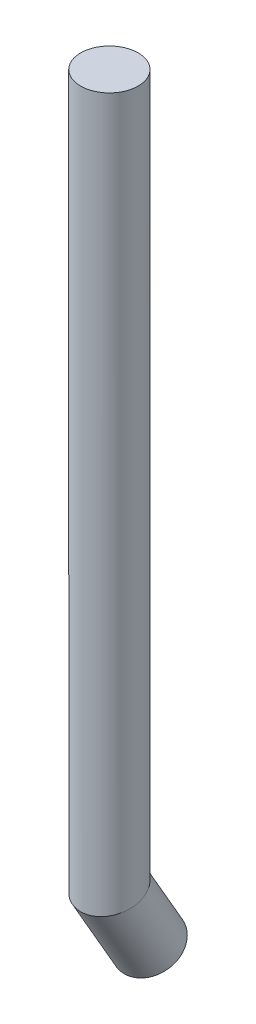
ISO-10303-21;
HEADER;
FILE_DESCRIPTION(('STEP AP214'),'2;1');
FILE_NAME('part.step','',(''),(''),'','','');
FILE_SCHEMA(('AUTOMOTIVE_DESIGN { 1 0 10303 214 1 1 1 1 }'));
ENDSEC;
DATA;
#1=APPLICATION_CONTEXT('core data for automotive mechanical design processes');
#2=APPLICATION_PROTOCOL_DEFINITION('international standard','automotive_design',2000,#1);
#3=PRODUCT_CONTEXT('',#1,'mechanical');
#4=PRODUCT('Part','Part','',(#3));
#5=PRODUCT_RELATED_PRODUCT_CATEGORY('part','',(#4));
#6=PRODUCT_DEFINITION_FORMATION('','',#4);
#7=PRODUCT_DEFINITION_CONTEXT('part definition',#1,'design');
#8=PRODUCT_DEFINITION('design','',#6,#7);
#9=PRODUCT_DEFINITION_SHAPE('','',#8);
#10=(LENGTH_UNIT() NAMED_UNIT(*) SI_UNIT(.MILLI.,.METRE.));
#11=(NAMED_UNIT(*) PLANE_ANGLE_UNIT() SI_UNIT($,.RADIAN.));
#12=(NAMED_UNIT(*) SI_UNIT($,.STERADIAN.) SOLID_ANGLE_UNIT());
#13=UNCERTAINTY_MEASURE_WITH_UNIT(LENGTH_MEASURE(1.E-05),#10,'distance_accuracy_value','');
#14=(GEOMETRIC_REPRESENTATION_CONTEXT(3) GLOBAL_UNCERTAINTY_ASSIGNED_CONTEXT((#13)) GLOBAL_UNIT_ASSIGNED_CONTEXT((#10,
#11,#12)) REPRESENTATION_CONTEXT('',''));
#15=CARTESIAN_POINT('',(0.,0.,0.));
#16=DIRECTION('',(0.,0.,1.));
#17=DIRECTION('',(1.,0.,0.));
#18=AXIS2_PLACEMENT_3D('',#15,#16,#17);
#19=CARTESIAN_POINT('',(-15.746,17.847,11.175388531));
#20=DIRECTION('',(0.,-0.866025403629099,-0.500000000269057));
#21=DIRECTION('',(0.,0.500000000269057,-0.866025403629099));
#22=AXIS2_PLACEMENT_3D('',#19,#20,#21);
#23=PLANE('',#22);
#24=CARTESIAN_POINT('',(-15.24,18.0999999999651,10.7371796769515));
#25=DIRECTION('',(0.,-0.866025403784329,-0.50000000000019));
#26=DIRECTION('',(0.,0.50000000000019,-0.866025403784329));
#27=AXIS2_PLACEMENT_3D('',#24,#25,#26);
#28=CIRCLE('',#27,0.499999999958);
#29=CARTESIAN_POINT('',(-15.24,18.3499999999442,10.3041669750957));
#30=VERTEX_POINT('',#29);
#31=EDGE_CURVE('E18',#30,#30,#28,.F.);
#32=ORIENTED_EDGE('',*,*,#31,.F.);
#33=EDGE_LOOP('',(#32));
#34=FACE_BOUND('',#33,.T.);
#35=ADVANCED_FACE('F15',(#34),#23,.T.);
#36=CARTESIAN_POINT('',(-15.746,31.6,11.936));
#37=DIRECTION('',(0.,-1.,0.));
#38=DIRECTION('',(0.,0.,-1.));
#39=AXIS2_PLACEMENT_3D('',#36,#37,#38);
#40=PLANE('',#39);
#41=CARTESIAN_POINT('',(-15.24,31.6,11.43));
#42=DIRECTION('',(0.,-1.,0.));
#43=DIRECTION('',(0.,0.,-1.));
#44=AXIS2_PLACEMENT_3D('',#41,#42,#43);
#45=CIRCLE('',#44,0.5);
#46=CARTESIAN_POINT('',(-15.24,31.6,10.93));
#47=VERTEX_POINT('',#46);
#48=EDGE_CURVE('E22',#47,#47,#45,.T.);
#49=ORIENTED_EDGE('',*,*,#48,.F.);
#50=EDGE_LOOP('',(#49));
#51=FACE_BOUND('',#50,.T.);
#52=ADVANCED_FACE('F36',(#51),#40,.F.);
#53=CARTESIAN_POINT('',(-15.24,19.423921556077,11.501546143759));
#54=DIRECTION('',(0.,-0.866025403784329,-0.50000000000019));
#55=DIRECTION('',(0.,0.50000000000019,-0.866025403784329));
#56=AXIS2_PLACEMENT_3D('',#53,#54,#55);
#57=CYLINDRICAL_SURFACE('',#56,0.499999999958);
#58=ORIENTED_EDGE('',*,*,#31,.T.);
#59=EDGE_LOOP('',(#58));
#60=FACE_BOUND('',#59,.T.);
#61=CARTESIAN_POINT('',(-15.24,19.3000000000008,11.43));
#62=DIRECTION('',(0.,-0.96592582628904,-0.258819045102627));
#63=DIRECTION('',(0.,-0.258819045102627,0.96592582628904));
#64=AXIS2_PLACEMENT_3D('',#61,#62,#63);
#65=ELLIPSE('',#64,0.517638090183316,0.499999999979);
#66=CARTESIAN_POINT('',(-15.24,19.1660254037909,11.929999999979));
#67=VERTEX_POINT('',#66);
#68=EDGE_CURVE('E10',#67,#67,#65,.F.);
#69=ORIENTED_EDGE('',*,*,#68,.F.);
#70=EDGE_LOOP('',(#69));
#71=FACE_BOUND('',#70,.T.);
#72=ADVANCED_FACE('F32',(#60,#71),#57,.T.);
#73=CARTESIAN_POINT('',(-15.24,31.6,11.43));
#74=DIRECTION('',(0.,-1.,0.));
#75=DIRECTION('',(0.,0.,-1.));
#76=AXIS2_PLACEMENT_3D('',#73,#74,#75);
#77=CYLINDRICAL_SURFACE('',#76,0.5);
#78=ORIENTED_EDGE('',*,*,#48,.T.);
#79=EDGE_LOOP('',(#78));
#80=FACE_BOUND('',#79,.T.);
#81=ORIENTED_EDGE('',*,*,#68,.T.);
#82=EDGE_LOOP('',(#81));
#83=FACE_BOUND('',#82,.T.);
#84=ADVANCED_FACE('F42',(#80,#83),#77,.T.);
#85=CLOSED_SHELL('',(#35,#52,#72,#84));
#86=MANIFOLD_SOLID_BREP('B1',#85);
#87=ADVANCED_BREP_SHAPE_REPRESENTATION('',(#18,#86),#14);
#88=SHAPE_DEFINITION_REPRESENTATION(#9,#87);
ENDSEC;
END-ISO-10303-21;
